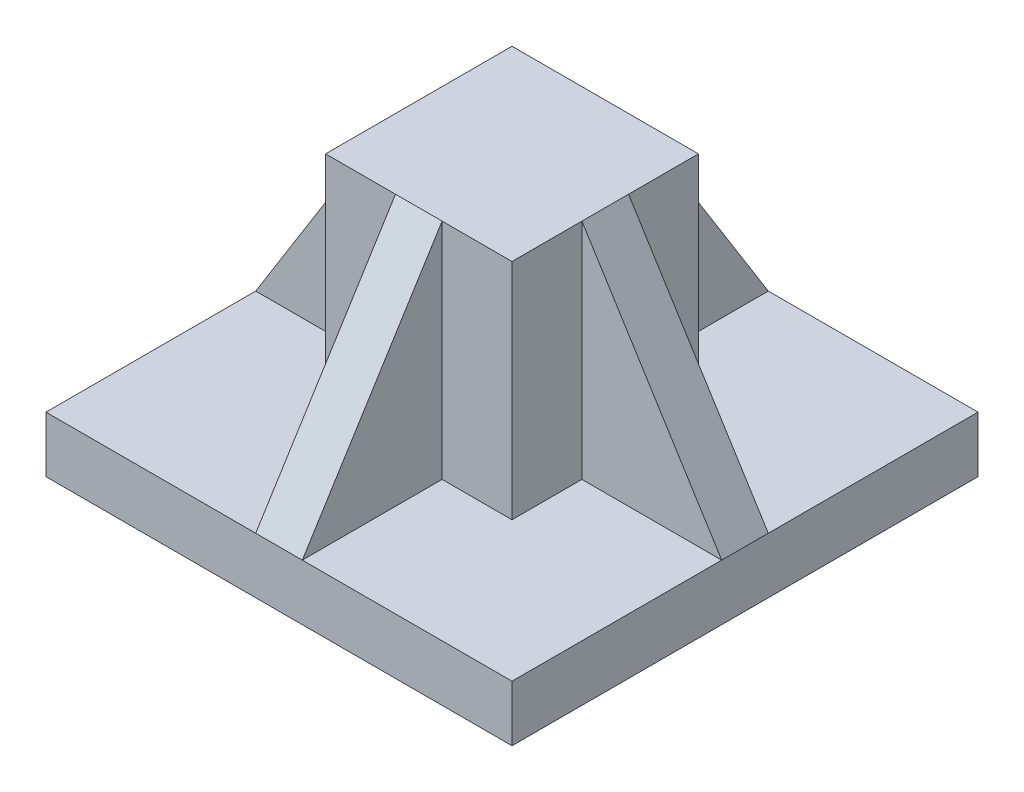
ISO-10303-21;
HEADER;
FILE_DESCRIPTION(('STEP AP214'),'2;1');
FILE_NAME('part.step','',(''),(''),'','','');
FILE_SCHEMA(('AUTOMOTIVE_DESIGN { 1 0 10303 214 1 1 1 1 }'));
ENDSEC;
DATA;
#1=APPLICATION_CONTEXT('core data for automotive mechanical design processes');
#2=APPLICATION_PROTOCOL_DEFINITION('international standard','automotive_design',2000,#1);
#3=PRODUCT_CONTEXT('',#1,'mechanical');
#4=PRODUCT('Part','Part','',(#3));
#5=PRODUCT_RELATED_PRODUCT_CATEGORY('part','',(#4));
#6=PRODUCT_DEFINITION_FORMATION('','',#4);
#7=PRODUCT_DEFINITION_CONTEXT('part definition',#1,'design');
#8=PRODUCT_DEFINITION('design','',#6,#7);
#9=PRODUCT_DEFINITION_SHAPE('','',#8);
#10=(LENGTH_UNIT() NAMED_UNIT(*) SI_UNIT(.MILLI.,.METRE.));
#11=(NAMED_UNIT(*) PLANE_ANGLE_UNIT() SI_UNIT($,.RADIAN.));
#12=(NAMED_UNIT(*) SI_UNIT($,.STERADIAN.) SOLID_ANGLE_UNIT());
#13=UNCERTAINTY_MEASURE_WITH_UNIT(LENGTH_MEASURE(1.E-05),#10,'distance_accuracy_value','');
#14=(GEOMETRIC_REPRESENTATION_CONTEXT(3) GLOBAL_UNCERTAINTY_ASSIGNED_CONTEXT((#13)) GLOBAL_UNIT_ASSIGNED_CONTEXT((#10,
#11,#12)) REPRESENTATION_CONTEXT('',''));
#15=CARTESIAN_POINT('',(0.,0.,0.));
#16=DIRECTION('',(0.,0.,1.));
#17=DIRECTION('',(1.,0.,0.));
#18=AXIS2_PLACEMENT_3D('',#15,#16,#17);
#19=CARTESIAN_POINT('',(0.,12.,0.));
#20=DIRECTION('',(0.,-1.,0.));
#21=DIRECTION('',(0.,0.,-1.));
#22=AXIS2_PLACEMENT_3D('',#19,#20,#21);
#23=PLANE('',#22);
#24=DIRECTION('',(0.,0.,-1.));
#25=VECTOR('',#24,1.);
#26=CARTESIAN_POINT('',(-5.,12.,-50.));
#27=LINE('',#26,#25);
#28=CARTESIAN_POINT('',(-5.,12.,-20.));
#29=VERTEX_POINT('',#28);
#30=CARTESIAN_POINT('',(-5.,12.,-50.));
#31=VERTEX_POINT('',#30);
#32=EDGE_CURVE('E418',#29,#31,#27,.T.);
#33=ORIENTED_EDGE('',*,*,#32,.T.);
#34=DIRECTION('',(-1.,0.,0.));
#35=VECTOR('',#34,1.);
#36=CARTESIAN_POINT('',(-50.,12.,-50.));
#37=LINE('',#36,#35);
#38=CARTESIAN_POINT('',(-50.,12.,-50.));
#39=VERTEX_POINT('',#38);
#40=EDGE_CURVE('E237',#31,#39,#37,.T.);
#41=ORIENTED_EDGE('',*,*,#40,.T.);
#42=DIRECTION('',(0.,0.,1.));
#43=VECTOR('',#42,1.);
#44=CARTESIAN_POINT('',(-50.,12.,50.));
#45=LINE('',#44,#43);
#46=CARTESIAN_POINT('',(-50.,12.,-5.));
#47=VERTEX_POINT('',#46);
#48=EDGE_CURVE('E244',#39,#47,#45,.T.);
#49=ORIENTED_EDGE('',*,*,#48,.T.);
#50=DIRECTION('',(1.,0.,0.));
#51=VECTOR('',#50,1.);
#52=CARTESIAN_POINT('',(-20.,12.,-5.));
#53=LINE('',#52,#51);
#54=CARTESIAN_POINT('',(-20.,12.,-5.));
#55=VERTEX_POINT('',#54);
#56=EDGE_CURVE('E369',#47,#55,#53,.T.);
#57=ORIENTED_EDGE('',*,*,#56,.T.);
#58=DIRECTION('',(0.,0.,1.));
#59=VECTOR('',#58,1.);
#60=CARTESIAN_POINT('',(-20.,12.,0.));
#61=LINE('',#60,#59);
#62=CARTESIAN_POINT('',(-20.,12.,-20.));
#63=VERTEX_POINT('',#62);
#64=EDGE_CURVE('E220',#63,#55,#61,.T.);
#65=ORIENTED_EDGE('',*,*,#64,.F.);
#66=DIRECTION('',(-1.,0.,0.));
#67=VECTOR('',#66,1.);
#68=CARTESIAN_POINT('',(0.,12.,-20.));
#69=LINE('',#68,#67);
#70=EDGE_CURVE('E224',#29,#63,#69,.T.);
#71=ORIENTED_EDGE('',*,*,#70,.F.);
#72=EDGE_LOOP('',(#33,#41,#49,#57,#65,#71));
#73=FACE_BOUND('',#72,.T.);
#74=ADVANCED_FACE('F45',(#73),#23,.F.);
#75=DIRECTION('',(0.,0.,-1.));
#76=VECTOR('',#75,1.);
#77=CARTESIAN_POINT('',(-5.,12.,20.));
#78=LINE('',#77,#76);
#79=CARTESIAN_POINT('',(-5.,12.,50.));
#80=VERTEX_POINT('',#79);
#81=CARTESIAN_POINT('',(-5.,12.,20.));
#82=VERTEX_POINT('',#81);
#83=EDGE_CURVE('E321',#80,#82,#78,.T.);
#84=ORIENTED_EDGE('',*,*,#83,.T.);
#85=DIRECTION('',(1.,0.,0.));
#86=VECTOR('',#85,1.);
#87=CARTESIAN_POINT('',(0.,12.,20.));
#88=LINE('',#87,#86);
#89=CARTESIAN_POINT('',(-20.,12.,20.));
#90=VERTEX_POINT('',#89);
#91=EDGE_CURVE('E208',#90,#82,#88,.T.);
#92=ORIENTED_EDGE('',*,*,#91,.F.);
#93=CARTESIAN_POINT('',(-20.,12.,5.));
#94=VERTEX_POINT('',#93);
#95=EDGE_CURVE('E214',#94,#90,#61,.T.);
#96=ORIENTED_EDGE('',*,*,#95,.F.);
#97=DIRECTION('',(1.,0.,0.));
#98=VECTOR('',#97,1.);
#99=CARTESIAN_POINT('',(-20.,12.,5.));
#100=LINE('',#99,#98);
#101=CARTESIAN_POINT('',(-50.,12.,5.));
#102=VERTEX_POINT('',#101);
#103=EDGE_CURVE('E359',#102,#94,#100,.T.);
#104=ORIENTED_EDGE('',*,*,#103,.F.);
#105=CARTESIAN_POINT('',(-50.,12.,50.));
#106=VERTEX_POINT('',#105);
#107=EDGE_CURVE('E243',#102,#106,#45,.T.);
#108=ORIENTED_EDGE('',*,*,#107,.T.);
#109=DIRECTION('',(1.,0.,0.));
#110=VECTOR('',#109,1.);
#111=CARTESIAN_POINT('',(-50.,12.,50.));
#112=LINE('',#111,#110);
#113=EDGE_CURVE('E249',#106,#80,#112,.T.);
#114=ORIENTED_EDGE('',*,*,#113,.T.);
#115=EDGE_LOOP('',(#84,#92,#96,#104,#108,#114));
#116=FACE_BOUND('',#115,.T.);
#117=ADVANCED_FACE('F320',(#116),#23,.F.);
#118=CARTESIAN_POINT('',(-20.,60.,-20.));
#119=DIRECTION('',(0.,0.,1.));
#120=DIRECTION('',(1.,0.,0.));
#121=AXIS2_PLACEMENT_3D('',#118,#119,#120);
#122=PLANE('',#121);
#123=DIRECTION('',(0.,-1.,0.));
#124=VECTOR('',#123,1.);
#125=CARTESIAN_POINT('',(-5.,12.,-20.));
#126=LINE('',#125,#124);
#127=CARTESIAN_POINT('',(-5.,60.,-20.));
#128=VERTEX_POINT('',#127);
#129=EDGE_CURVE('E414',#128,#29,#126,.T.);
#130=ORIENTED_EDGE('',*,*,#129,.T.);
#131=ORIENTED_EDGE('',*,*,#70,.T.);
#132=DIRECTION('',(0.,-1.,0.));
#133=VECTOR('',#132,1.);
#134=CARTESIAN_POINT('',(-20.,60.,-20.));
#135=LINE('',#134,#133);
#136=CARTESIAN_POINT('',(-20.,60.,-20.));
#137=VERTEX_POINT('',#136);
#138=EDGE_CURVE('E216',#137,#63,#135,.T.);
#139=ORIENTED_EDGE('',*,*,#138,.F.);
#140=DIRECTION('',(-1.,0.,0.));
#141=VECTOR('',#140,1.);
#142=CARTESIAN_POINT('',(-20.,60.,-20.));
#143=LINE('',#142,#141);
#144=EDGE_CURVE('E346',#128,#137,#143,.T.);
#145=ORIENTED_EDGE('',*,*,#144,.F.);
#146=EDGE_LOOP('',(#130,#131,#139,#145));
#147=FACE_BOUND('',#146,.T.);
#148=ADVANCED_FACE('F491',(#147),#122,.F.);
#149=CARTESIAN_POINT('',(-20.,60.,20.));
#150=DIRECTION('',(0.,0.,-1.));
#151=DIRECTION('',(-1.,0.,0.));
#152=AXIS2_PLACEMENT_3D('',#149,#150,#151);
#153=PLANE('',#152);
#154=DIRECTION('',(0.,1.,0.));
#155=VECTOR('',#154,1.);
#156=CARTESIAN_POINT('',(-5.,60.,20.));
#157=LINE('',#156,#155);
#158=CARTESIAN_POINT('',(-5.,60.,20.));
#159=VERTEX_POINT('',#158);
#160=EDGE_CURVE('E440',#82,#159,#157,.T.);
#161=ORIENTED_EDGE('',*,*,#160,.T.);
#162=DIRECTION('',(1.,0.,0.));
#163=VECTOR('',#162,1.);
#164=CARTESIAN_POINT('',(-20.,60.,20.));
#165=LINE('',#164,#163);
#166=CARTESIAN_POINT('',(-20.,60.,20.));
#167=VERTEX_POINT('',#166);
#168=EDGE_CURVE('E326',#167,#159,#165,.T.);
#169=ORIENTED_EDGE('',*,*,#168,.F.);
#170=DIRECTION('',(0.,-1.,0.));
#171=VECTOR('',#170,1.);
#172=CARTESIAN_POINT('',(-20.,60.,20.));
#173=LINE('',#172,#171);
#174=EDGE_CURVE('E314',#167,#90,#173,.T.);
#175=ORIENTED_EDGE('',*,*,#174,.T.);
#176=ORIENTED_EDGE('',*,*,#91,.T.);
#177=EDGE_LOOP('',(#161,#169,#175,#176));
#178=FACE_BOUND('',#177,.T.);
#179=ADVANCED_FACE('F324',(#178),#153,.F.);
#180=CARTESIAN_POINT('',(50.,12.,-50.));
#181=VERTEX_POINT('',#180);
#182=CARTESIAN_POINT('',(5.,12.,-50.));
#183=VERTEX_POINT('',#182);
#184=EDGE_CURVE('E239',#181,#183,#37,.T.);
#185=ORIENTED_EDGE('',*,*,#184,.T.);
#186=DIRECTION('',(0.,0.,-1.));
#187=VECTOR('',#186,1.);
#188=CARTESIAN_POINT('',(5.,12.,-50.));
#189=LINE('',#188,#187);
#190=CARTESIAN_POINT('',(5.,12.,-20.));
#191=VERTEX_POINT('',#190);
#192=EDGE_CURVE('E407',#191,#183,#189,.T.);
#193=ORIENTED_EDGE('',*,*,#192,.F.);
#194=CARTESIAN_POINT('',(20.,12.,-20.));
#195=VERTEX_POINT('',#194);
#196=EDGE_CURVE('E225',#195,#191,#69,.T.);
#197=ORIENTED_EDGE('',*,*,#196,.F.);
#198=DIRECTION('',(0.,0.,-1.));
#199=VECTOR('',#198,1.);
#200=CARTESIAN_POINT('',(20.,12.,0.));
#201=LINE('',#200,#199);
#202=CARTESIAN_POINT('',(20.,12.,-5.));
#203=VERTEX_POINT('',#202);
#204=EDGE_CURVE('E229',#203,#195,#201,.T.);
#205=ORIENTED_EDGE('',*,*,#204,.F.);
#206=DIRECTION('',(1.,0.,0.));
#207=VECTOR('',#206,1.);
#208=CARTESIAN_POINT('',(50.,12.,-5.));
#209=LINE('',#208,#207);
#210=CARTESIAN_POINT('',(50.,12.,-5.));
#211=VERTEX_POINT('',#210);
#212=EDGE_CURVE('E389',#203,#211,#209,.T.);
#213=ORIENTED_EDGE('',*,*,#212,.T.);
#214=DIRECTION('',(0.,0.,-1.));
#215=VECTOR('',#214,1.);
#216=CARTESIAN_POINT('',(50.,12.,50.));
#217=LINE('',#216,#215);
#218=EDGE_CURVE('E238',#211,#181,#217,.T.);
#219=ORIENTED_EDGE('',*,*,#218,.T.);
#220=EDGE_LOOP('',(#185,#193,#197,#205,#213,#219));
#221=FACE_BOUND('',#220,.T.);
#222=ADVANCED_FACE('F477',(#221),#23,.F.);
#223=CARTESIAN_POINT('',(20.,60.,20.));
#224=DIRECTION('',(-1.,0.,0.));
#225=DIRECTION('',(0.,0.,1.));
#226=AXIS2_PLACEMENT_3D('',#223,#224,#225);
#227=PLANE('',#226);
#228=DIRECTION('',(0.,-1.,0.));
#229=VECTOR('',#228,1.);
#230=CARTESIAN_POINT('',(20.,12.,-5.));
#231=LINE('',#230,#229);
#232=CARTESIAN_POINT('',(20.,60.,-5.));
#233=VERTEX_POINT('',#232);
#234=EDGE_CURVE('E393',#233,#203,#231,.T.);
#235=ORIENTED_EDGE('',*,*,#234,.T.);
#236=ORIENTED_EDGE('',*,*,#204,.T.);
#237=DIRECTION('',(0.,-1.,0.));
#238=VECTOR('',#237,1.);
#239=CARTESIAN_POINT('',(20.,60.,-20.));
#240=LINE('',#239,#238);
#241=CARTESIAN_POINT('',(20.,60.,-20.));
#242=VERTEX_POINT('',#241);
#243=EDGE_CURVE('E209',#242,#195,#240,.T.);
#244=ORIENTED_EDGE('',*,*,#243,.F.);
#245=DIRECTION('',(0.,0.,-1.));
#246=VECTOR('',#245,1.);
#247=CARTESIAN_POINT('',(20.,60.,20.));
#248=LINE('',#247,#246);
#249=EDGE_CURVE('E351',#233,#242,#248,.T.);
#250=ORIENTED_EDGE('',*,*,#249,.F.);
#251=EDGE_LOOP('',(#235,#236,#244,#250));
#252=FACE_BOUND('',#251,.T.);
#253=ADVANCED_FACE('F472',(#252),#227,.F.);
#254=CARTESIAN_POINT('',(-20.,60.,20.));
#255=DIRECTION('',(1.,0.,0.));
#256=DIRECTION('',(0.,0.,-1.));
#257=AXIS2_PLACEMENT_3D('',#254,#255,#256);
#258=PLANE('',#257);
#259=DIRECTION('',(0.,1.,0.));
#260=VECTOR('',#259,1.);
#261=CARTESIAN_POINT('',(-20.,60.,5.));
#262=LINE('',#261,#260);
#263=CARTESIAN_POINT('',(-20.,60.,5.));
#264=VERTEX_POINT('',#263);
#265=EDGE_CURVE('E316',#94,#264,#262,.T.);
#266=ORIENTED_EDGE('',*,*,#265,.F.);
#267=ORIENTED_EDGE('',*,*,#95,.T.);
#268=ORIENTED_EDGE('',*,*,#174,.F.);
#269=DIRECTION('',(0.,0.,1.));
#270=VECTOR('',#269,1.);
#271=CARTESIAN_POINT('',(-20.,60.,20.));
#272=LINE('',#271,#270);
#273=EDGE_CURVE('E341',#264,#167,#272,.T.);
#274=ORIENTED_EDGE('',*,*,#273,.F.);
#275=EDGE_LOOP('',(#266,#267,#268,#274));
#276=FACE_BOUND('',#275,.T.);
#277=ADVANCED_FACE('F311',(#276),#258,.F.);
#278=CARTESIAN_POINT('',(5.,12.,20.));
#279=VERTEX_POINT('',#278);
#280=CARTESIAN_POINT('',(20.,12.,20.));
#281=VERTEX_POINT('',#280);
#282=EDGE_CURVE('E196',#279,#281,#88,.T.);
#283=ORIENTED_EDGE('',*,*,#282,.F.);
#284=DIRECTION('',(0.,0.,-1.));
#285=VECTOR('',#284,1.);
#286=CARTESIAN_POINT('',(5.,12.,20.));
#287=LINE('',#286,#285);
#288=CARTESIAN_POINT('',(5.,12.,50.));
#289=VERTEX_POINT('',#288);
#290=EDGE_CURVE('E182',#289,#279,#287,.T.);
#291=ORIENTED_EDGE('',*,*,#290,.F.);
#292=CARTESIAN_POINT('',(50.,12.,50.));
#293=VERTEX_POINT('',#292);
#294=EDGE_CURVE('E248',#289,#293,#112,.T.);
#295=ORIENTED_EDGE('',*,*,#294,.T.);
#296=CARTESIAN_POINT('',(50.,12.,5.));
#297=VERTEX_POINT('',#296);
#298=EDGE_CURVE('E233',#293,#297,#217,.T.);
#299=ORIENTED_EDGE('',*,*,#298,.T.);
#300=DIRECTION('',(1.,0.,0.));
#301=VECTOR('',#300,1.);
#302=CARTESIAN_POINT('',(50.,12.,5.));
#303=LINE('',#302,#301);
#304=CARTESIAN_POINT('',(20.,12.,5.));
#305=VERTEX_POINT('',#304);
#306=EDGE_CURVE('E297',#305,#297,#303,.T.);
#307=ORIENTED_EDGE('',*,*,#306,.F.);
#308=EDGE_CURVE('E205',#281,#305,#201,.T.);
#309=ORIENTED_EDGE('',*,*,#308,.F.);
#310=EDGE_LOOP('',(#283,#291,#295,#299,#307,#309));
#311=FACE_BOUND('',#310,.T.);
#312=ADVANCED_FACE('F202',(#311),#23,.F.);
#313=CARTESIAN_POINT('',(50.,12.,50.));
#314=DIRECTION('',(-1.,0.,0.));
#315=DIRECTION('',(0.,0.,1.));
#316=AXIS2_PLACEMENT_3D('',#313,#314,#315);
#317=PLANE('',#316);
#318=DIRECTION('',(0.,0.,-1.));
#319=VECTOR('',#318,1.);
#320=CARTESIAN_POINT('',(50.,0.,50.));
#321=LINE('',#320,#319);
#322=CARTESIAN_POINT('',(50.,0.,50.));
#323=VERTEX_POINT('',#322);
#324=CARTESIAN_POINT('',(50.,0.,-50.));
#325=VERTEX_POINT('',#324);
#326=EDGE_CURVE('E232',#323,#325,#321,.T.);
#327=ORIENTED_EDGE('',*,*,#326,.T.);
#328=DIRECTION('',(0.,-1.,0.));
#329=VECTOR('',#328,1.);
#330=CARTESIAN_POINT('',(50.,12.,-50.));
#331=LINE('',#330,#329);
#332=EDGE_CURVE('E11',#181,#325,#331,.T.);
#333=ORIENTED_EDGE('',*,*,#332,.F.);
#334=ORIENTED_EDGE('',*,*,#218,.F.);
#335=DIRECTION('',(0.,0.,1.));
#336=VECTOR('',#335,1.);
#337=CARTESIAN_POINT('',(50.,12.,-5.));
#338=LINE('',#337,#336);
#339=EDGE_CURVE('E296',#211,#297,#338,.T.);
#340=ORIENTED_EDGE('',*,*,#339,.T.);
#341=ORIENTED_EDGE('',*,*,#298,.F.);
#342=DIRECTION('',(0.,-1.,0.));
#343=VECTOR('',#342,1.);
#344=CARTESIAN_POINT('',(50.,12.,50.));
#345=LINE('',#344,#343);
#346=EDGE_CURVE('E253',#293,#323,#345,.T.);
#347=ORIENTED_EDGE('',*,*,#346,.T.);
#348=EDGE_LOOP('',(#327,#333,#334,#340,#341,#347));
#349=FACE_BOUND('',#348,.T.);
#350=ADVANCED_FACE('F47',(#349),#317,.F.);
#351=CARTESIAN_POINT('',(-50.,12.,-50.));
#352=DIRECTION('',(0.,0.,1.));
#353=DIRECTION('',(1.,0.,0.));
#354=AXIS2_PLACEMENT_3D('',#351,#352,#353);
#355=PLANE('',#354);
#356=DIRECTION('',(-1.,0.,0.));
#357=VECTOR('',#356,1.);
#358=CARTESIAN_POINT('',(-50.,0.,-50.));
#359=LINE('',#358,#357);
#360=CARTESIAN_POINT('',(-50.,0.,-50.));
#361=VERTEX_POINT('',#360);
#362=EDGE_CURVE('E257',#325,#361,#359,.T.);
#363=ORIENTED_EDGE('',*,*,#362,.T.);
#364=DIRECTION('',(0.,-1.,0.));
#365=VECTOR('',#364,1.);
#366=CARTESIAN_POINT('',(-50.,12.,-50.));
#367=LINE('',#366,#365);
#368=EDGE_CURVE('E54',#39,#361,#367,.T.);
#369=ORIENTED_EDGE('',*,*,#368,.F.);
#370=ORIENTED_EDGE('',*,*,#40,.F.);
#371=DIRECTION('',(1.,0.,0.));
#372=VECTOR('',#371,1.);
#373=CARTESIAN_POINT('',(-5.,12.,-50.));
#374=LINE('',#373,#372);
#375=EDGE_CURVE('E424',#31,#183,#374,.T.);
#376=ORIENTED_EDGE('',*,*,#375,.T.);
#377=ORIENTED_EDGE('',*,*,#184,.F.);
#378=ORIENTED_EDGE('',*,*,#332,.T.);
#379=EDGE_LOOP('',(#363,#369,#370,#376,#377,#378));
#380=FACE_BOUND('',#379,.T.);
#381=ADVANCED_FACE('F483',(#380),#355,.F.);
#382=CARTESIAN_POINT('',(-50.,12.,50.));
#383=DIRECTION('',(1.,0.,0.));
#384=DIRECTION('',(0.,0.,-1.));
#385=AXIS2_PLACEMENT_3D('',#382,#383,#384);
#386=PLANE('',#385);
#387=DIRECTION('',(0.,0.,1.));
#388=VECTOR('',#387,1.);
#389=CARTESIAN_POINT('',(-50.,0.,50.));
#390=LINE('',#389,#388);
#391=CARTESIAN_POINT('',(-50.,0.,50.));
#392=VERTEX_POINT('',#391);
#393=EDGE_CURVE('E260',#361,#392,#390,.T.);
#394=ORIENTED_EDGE('',*,*,#393,.T.);
#395=DIRECTION('',(0.,-1.,0.));
#396=VECTOR('',#395,1.);
#397=CARTESIAN_POINT('',(-50.,12.,50.));
#398=LINE('',#397,#396);
#399=EDGE_CURVE('E269',#106,#392,#398,.T.);
#400=ORIENTED_EDGE('',*,*,#399,.F.);
#401=ORIENTED_EDGE('',*,*,#107,.F.);
#402=DIRECTION('',(0.,0.,1.));
#403=VECTOR('',#402,1.);
#404=CARTESIAN_POINT('',(-50.,12.,-5.));
#405=LINE('',#404,#403);
#406=EDGE_CURVE('E374',#47,#102,#405,.T.);
#407=ORIENTED_EDGE('',*,*,#406,.F.);
#408=ORIENTED_EDGE('',*,*,#48,.F.);
#409=ORIENTED_EDGE('',*,*,#368,.T.);
#410=EDGE_LOOP('',(#394,#400,#401,#407,#408,#409));
#411=FACE_BOUND('',#410,.T.);
#412=ADVANCED_FACE('F278',(#411),#386,.F.);
#413=CARTESIAN_POINT('',(-50.,12.,50.));
#414=DIRECTION('',(0.,0.,-1.));
#415=DIRECTION('',(-1.,0.,0.));
#416=AXIS2_PLACEMENT_3D('',#413,#414,#415);
#417=PLANE('',#416);
#418=DIRECTION('',(1.,0.,0.));
#419=VECTOR('',#418,1.);
#420=CARTESIAN_POINT('',(-50.,0.,50.));
#421=LINE('',#420,#419);
#422=EDGE_CURVE('E263',#392,#323,#421,.T.);
#423=ORIENTED_EDGE('',*,*,#422,.T.);
#424=ORIENTED_EDGE('',*,*,#346,.F.);
#425=ORIENTED_EDGE('',*,*,#294,.F.);
#426=DIRECTION('',(1.,0.,0.));
#427=VECTOR('',#426,1.);
#428=CARTESIAN_POINT('',(-5.,12.,50.));
#429=LINE('',#428,#427);
#430=EDGE_CURVE('E377',#80,#289,#429,.T.);
#431=ORIENTED_EDGE('',*,*,#430,.F.);
#432=ORIENTED_EDGE('',*,*,#113,.F.);
#433=ORIENTED_EDGE('',*,*,#399,.T.);
#434=EDGE_LOOP('',(#423,#424,#425,#431,#432,#433));
#435=FACE_BOUND('',#434,.T.);
#436=ADVANCED_FACE('F289',(#435),#417,.F.);
#437=CARTESIAN_POINT('',(0.,0.,0.));
#438=DIRECTION('',(0.,-1.,0.));
#439=DIRECTION('',(0.,0.,-1.));
#440=AXIS2_PLACEMENT_3D('',#437,#438,#439);
#441=PLANE('',#440);
#442=ORIENTED_EDGE('',*,*,#326,.F.);
#443=ORIENTED_EDGE('',*,*,#422,.F.);
#444=ORIENTED_EDGE('',*,*,#393,.F.);
#445=ORIENTED_EDGE('',*,*,#362,.F.);
#446=EDGE_LOOP('',(#442,#443,#444,#445));
#447=FACE_BOUND('',#446,.T.);
#448=ADVANCED_FACE('F286',(#447),#441,.T.);
#449=ORIENTED_EDGE('',*,*,#308,.T.);
#450=DIRECTION('',(0.,-1.,0.));
#451=VECTOR('',#450,1.);
#452=CARTESIAN_POINT('',(20.,12.,5.));
#453=LINE('',#452,#451);
#454=CARTESIAN_POINT('',(20.,60.,5.));
#455=VERTEX_POINT('',#454);
#456=EDGE_CURVE('E354',#455,#305,#453,.T.);
#457=ORIENTED_EDGE('',*,*,#456,.F.);
#458=CARTESIAN_POINT('',(20.,60.,20.));
#459=VERTEX_POINT('',#458);
#460=EDGE_CURVE('E347',#459,#455,#248,.T.);
#461=ORIENTED_EDGE('',*,*,#460,.F.);
#462=DIRECTION('',(0.,-1.,0.));
#463=VECTOR('',#462,1.);
#464=CARTESIAN_POINT('',(20.,60.,20.));
#465=LINE('',#464,#463);
#466=EDGE_CURVE('E328',#459,#281,#465,.T.);
#467=ORIENTED_EDGE('',*,*,#466,.T.);
#468=EDGE_LOOP('',(#449,#457,#461,#467));
#469=FACE_BOUND('',#468,.T.);
#470=ADVANCED_FACE('F456',(#469),#227,.F.);
#471=ORIENTED_EDGE('',*,*,#196,.T.);
#472=DIRECTION('',(0.,-1.,0.));
#473=VECTOR('',#472,1.);
#474=CARTESIAN_POINT('',(5.,12.,-20.));
#475=LINE('',#474,#473);
#476=CARTESIAN_POINT('',(5.,60.,-20.));
#477=VERTEX_POINT('',#476);
#478=EDGE_CURVE('E191',#477,#191,#475,.T.);
#479=ORIENTED_EDGE('',*,*,#478,.F.);
#480=EDGE_CURVE('E342',#242,#477,#143,.T.);
#481=ORIENTED_EDGE('',*,*,#480,.F.);
#482=ORIENTED_EDGE('',*,*,#243,.T.);
#483=EDGE_LOOP('',(#471,#479,#481,#482));
#484=FACE_BOUND('',#483,.T.);
#485=ADVANCED_FACE('F471',(#484),#122,.F.);
#486=ORIENTED_EDGE('',*,*,#64,.T.);
#487=DIRECTION('',(0.,1.,0.));
#488=VECTOR('',#487,1.);
#489=CARTESIAN_POINT('',(-20.,60.,-5.));
#490=LINE('',#489,#488);
#491=CARTESIAN_POINT('',(-20.,60.,-5.));
#492=VERTEX_POINT('',#491);
#493=EDGE_CURVE('E362',#55,#492,#490,.T.);
#494=ORIENTED_EDGE('',*,*,#493,.T.);
#495=EDGE_CURVE('E337',#137,#492,#272,.T.);
#496=ORIENTED_EDGE('',*,*,#495,.F.);
#497=ORIENTED_EDGE('',*,*,#138,.T.);
#498=EDGE_LOOP('',(#486,#494,#496,#497));
#499=FACE_BOUND('',#498,.T.);
#500=ADVANCED_FACE('F495',(#499),#258,.F.);
#501=CARTESIAN_POINT('',(5.,60.,20.));
#502=VERTEX_POINT('',#501);
#503=EDGE_CURVE('E198',#502,#459,#165,.T.);
#504=ORIENTED_EDGE('',*,*,#503,.F.);
#505=DIRECTION('',(0.,1.,0.));
#506=VECTOR('',#505,1.);
#507=CARTESIAN_POINT('',(5.,60.,20.));
#508=LINE('',#507,#506);
#509=EDGE_CURVE('E185',#279,#502,#508,.T.);
#510=ORIENTED_EDGE('',*,*,#509,.F.);
#511=ORIENTED_EDGE('',*,*,#282,.T.);
#512=ORIENTED_EDGE('',*,*,#466,.F.);
#513=EDGE_LOOP('',(#504,#510,#511,#512));
#514=FACE_BOUND('',#513,.T.);
#515=ADVANCED_FACE('F194',(#514),#153,.F.);
#516=CARTESIAN_POINT('',(0.,60.,0.));
#517=DIRECTION('',(0.,-1.,0.));
#518=DIRECTION('',(0.,0.,-1.));
#519=AXIS2_PLACEMENT_3D('',#516,#517,#518);
#520=PLANE('',#519);
#521=ORIENTED_EDGE('',*,*,#460,.T.);
#522=DIRECTION('',(0.,0.,1.));
#523=VECTOR('',#522,1.);
#524=CARTESIAN_POINT('',(20.,60.,-5.));
#525=LINE('',#524,#523);
#526=EDGE_CURVE('E383',#233,#455,#525,.T.);
#527=ORIENTED_EDGE('',*,*,#526,.F.);
#528=ORIENTED_EDGE('',*,*,#249,.T.);
#529=ORIENTED_EDGE('',*,*,#480,.T.);
#530=DIRECTION('',(1.,0.,0.));
#531=VECTOR('',#530,1.);
#532=CARTESIAN_POINT('',(-5.,60.,-20.));
#533=LINE('',#532,#531);
#534=EDGE_CURVE('E425',#128,#477,#533,.T.);
#535=ORIENTED_EDGE('',*,*,#534,.F.);
#536=ORIENTED_EDGE('',*,*,#144,.T.);
#537=ORIENTED_EDGE('',*,*,#495,.T.);
#538=DIRECTION('',(0.,0.,1.));
#539=VECTOR('',#538,1.);
#540=CARTESIAN_POINT('',(-20.,60.,-5.));
#541=LINE('',#540,#539);
#542=EDGE_CURVE('E373',#492,#264,#541,.T.);
#543=ORIENTED_EDGE('',*,*,#542,.T.);
#544=ORIENTED_EDGE('',*,*,#273,.T.);
#545=ORIENTED_EDGE('',*,*,#168,.T.);
#546=DIRECTION('',(1.,0.,0.));
#547=VECTOR('',#546,1.);
#548=CARTESIAN_POINT('',(-5.,60.,20.));
#549=LINE('',#548,#547);
#550=EDGE_CURVE('E431',#159,#502,#549,.T.);
#551=ORIENTED_EDGE('',*,*,#550,.T.);
#552=ORIENTED_EDGE('',*,*,#503,.T.);
#553=EDGE_LOOP('',(#521,#527,#528,#529,#535,#536,#537,#543,#544,#545,#551,#552));
#554=FACE_BOUND('',#553,.T.);
#555=ADVANCED_FACE('F451',(#554),#520,.F.);
#556=CARTESIAN_POINT('',(-20.,60.,-5.));
#557=DIRECTION('',(-0.847998304005088,0.52999894000318,0.));
#558=DIRECTION('',(-0.52999894000318,-0.847998304005088,0.));
#559=AXIS2_PLACEMENT_3D('',#556,#557,#558);
#560=PLANE('',#559);
#561=ORIENTED_EDGE('',*,*,#406,.T.);
#562=DIRECTION('',(-0.52999894000318,-0.847998304005088,0.));
#563=VECTOR('',#562,1.);
#564=CARTESIAN_POINT('',(-20.,60.,5.));
#565=LINE('',#564,#563);
#566=EDGE_CURVE('E355',#264,#102,#565,.T.);
#567=ORIENTED_EDGE('',*,*,#566,.F.);
#568=ORIENTED_EDGE('',*,*,#542,.F.);
#569=DIRECTION('',(-0.52999894000318,-0.847998304005088,0.));
#570=VECTOR('',#569,1.);
#571=CARTESIAN_POINT('',(-20.,60.,-5.));
#572=LINE('',#571,#570);
#573=EDGE_CURVE('E366',#492,#47,#572,.T.);
#574=ORIENTED_EDGE('',*,*,#573,.T.);
#575=EDGE_LOOP('',(#561,#567,#568,#574));
#576=FACE_BOUND('',#575,.T.);
#577=ADVANCED_FACE('F501',(#576),#560,.T.);
#578=CARTESIAN_POINT('',(0.,0.,-5.));
#579=DIRECTION('',(0.,0.,-1.));
#580=DIRECTION('',(-1.,0.,0.));
#581=AXIS2_PLACEMENT_3D('',#578,#579,#580);
#582=PLANE('',#581);
#583=ORIENTED_EDGE('',*,*,#493,.F.);
#584=ORIENTED_EDGE('',*,*,#56,.F.);
#585=ORIENTED_EDGE('',*,*,#573,.F.);
#586=EDGE_LOOP('',(#583,#584,#585));
#587=FACE_BOUND('',#586,.T.);
#588=ADVANCED_FACE('F499',(#587),#582,.T.);
#589=CARTESIAN_POINT('',(0.,0.,5.));
#590=DIRECTION('',(0.,0.,-1.));
#591=DIRECTION('',(-1.,0.,0.));
#592=AXIS2_PLACEMENT_3D('',#589,#590,#591);
#593=PLANE('',#592);
#594=ORIENTED_EDGE('',*,*,#265,.T.);
#595=ORIENTED_EDGE('',*,*,#566,.T.);
#596=ORIENTED_EDGE('',*,*,#103,.T.);
#597=EDGE_LOOP('',(#594,#595,#596));
#598=FACE_BOUND('',#597,.T.);
#599=ADVANCED_FACE('F504',(#598),#593,.F.);
#600=CARTESIAN_POINT('',(20.,60.,-5.));
#601=DIRECTION('',(0.847998304005088,0.52999894000318,0.));
#602=DIRECTION('',(-0.52999894000318,0.847998304005088,0.));
#603=AXIS2_PLACEMENT_3D('',#600,#601,#602);
#604=PLANE('',#603);
#605=ORIENTED_EDGE('',*,*,#526,.T.);
#606=DIRECTION('',(-0.52999894000318,0.847998304005088,0.));
#607=VECTOR('',#606,1.);
#608=CARTESIAN_POINT('',(20.,60.,5.));
#609=LINE('',#608,#607);
#610=EDGE_CURVE('E397',#297,#455,#609,.T.);
#611=ORIENTED_EDGE('',*,*,#610,.F.);
#612=ORIENTED_EDGE('',*,*,#339,.F.);
#613=DIRECTION('',(-0.52999894000318,0.847998304005088,0.));
#614=VECTOR('',#613,1.);
#615=CARTESIAN_POINT('',(20.,60.,-5.));
#616=LINE('',#615,#614);
#617=EDGE_CURVE('E384',#211,#233,#616,.T.);
#618=ORIENTED_EDGE('',*,*,#617,.T.);
#619=EDGE_LOOP('',(#605,#611,#612,#618));
#620=FACE_BOUND('',#619,.T.);
#621=ADVANCED_FACE('F461',(#620),#604,.T.);
#622=CARTESIAN_POINT('',(0.,0.,-5.));
#623=DIRECTION('',(0.,0.,1.));
#624=DIRECTION('',(1.,0.,0.));
#625=AXIS2_PLACEMENT_3D('',#622,#623,#624);
#626=PLANE('',#625);
#627=ORIENTED_EDGE('',*,*,#234,.F.);
#628=ORIENTED_EDGE('',*,*,#617,.F.);
#629=ORIENTED_EDGE('',*,*,#212,.F.);
#630=EDGE_LOOP('',(#627,#628,#629));
#631=FACE_BOUND('',#630,.T.);
#632=ADVANCED_FACE('F644',(#631),#626,.F.);
#633=CARTESIAN_POINT('',(0.,0.,5.));
#634=DIRECTION('',(0.,0.,1.));
#635=DIRECTION('',(1.,0.,0.));
#636=AXIS2_PLACEMENT_3D('',#633,#634,#635);
#637=PLANE('',#636);
#638=ORIENTED_EDGE('',*,*,#456,.T.);
#639=ORIENTED_EDGE('',*,*,#306,.T.);
#640=ORIENTED_EDGE('',*,*,#610,.T.);
#641=EDGE_LOOP('',(#638,#639,#640));
#642=FACE_BOUND('',#641,.T.);
#643=ADVANCED_FACE('F458',(#642),#637,.T.);
#644=CARTESIAN_POINT('',(-5.,60.,-20.));
#645=DIRECTION('',(0.,0.52999894000318,-0.847998304005088));
#646=DIRECTION('',(0.,0.847998304005088,0.52999894000318));
#647=AXIS2_PLACEMENT_3D('',#644,#645,#646);
#648=PLANE('',#647);
#649=ORIENTED_EDGE('',*,*,#534,.T.);
#650=DIRECTION('',(0.,0.847998304005088,0.52999894000318));
#651=VECTOR('',#650,1.);
#652=CARTESIAN_POINT('',(5.,60.,-20.));
#653=LINE('',#652,#651);
#654=EDGE_CURVE('E410',#183,#477,#653,.T.);
#655=ORIENTED_EDGE('',*,*,#654,.F.);
#656=ORIENTED_EDGE('',*,*,#375,.F.);
#657=DIRECTION('',(0.,0.847998304005088,0.52999894000318));
#658=VECTOR('',#657,1.);
#659=CARTESIAN_POINT('',(-5.,60.,-20.));
#660=LINE('',#659,#658);
#661=EDGE_CURVE('E69',#31,#128,#660,.T.);
#662=ORIENTED_EDGE('',*,*,#661,.T.);
#663=EDGE_LOOP('',(#649,#655,#656,#662));
#664=FACE_BOUND('',#663,.T.);
#665=ADVANCED_FACE('F482',(#664),#648,.T.);
#666=CARTESIAN_POINT('',(-5.,0.,0.));
#667=DIRECTION('',(1.,0.,0.));
#668=DIRECTION('',(0.,0.,-1.));
#669=AXIS2_PLACEMENT_3D('',#666,#667,#668);
#670=PLANE('',#669);
#671=ORIENTED_EDGE('',*,*,#129,.F.);
#672=ORIENTED_EDGE('',*,*,#661,.F.);
#673=ORIENTED_EDGE('',*,*,#32,.F.);
#674=EDGE_LOOP('',(#671,#672,#673));
#675=FACE_BOUND('',#674,.T.);
#676=ADVANCED_FACE('F488',(#675),#670,.F.);
#677=CARTESIAN_POINT('',(5.,0.,0.));
#678=DIRECTION('',(1.,0.,0.));
#679=DIRECTION('',(0.,0.,-1.));
#680=AXIS2_PLACEMENT_3D('',#677,#678,#679);
#681=PLANE('',#680);
#682=ORIENTED_EDGE('',*,*,#478,.T.);
#683=ORIENTED_EDGE('',*,*,#192,.T.);
#684=ORIENTED_EDGE('',*,*,#654,.T.);
#685=EDGE_LOOP('',(#682,#683,#684));
#686=FACE_BOUND('',#685,.T.);
#687=ADVANCED_FACE('F481',(#686),#681,.T.);
#688=CARTESIAN_POINT('',(-5.,12.,50.));
#689=DIRECTION('',(0.,0.52999894000318,0.847998304005088));
#690=DIRECTION('',(0.,-0.847998304005088,0.52999894000318));
#691=AXIS2_PLACEMENT_3D('',#688,#689,#690);
#692=PLANE('',#691);
#693=ORIENTED_EDGE('',*,*,#430,.T.);
#694=DIRECTION('',(0.,-0.847998304005088,0.52999894000318));
#695=VECTOR('',#694,1.);
#696=CARTESIAN_POINT('',(5.,12.,50.));
#697=LINE('',#696,#695);
#698=EDGE_CURVE('E61',#502,#289,#697,.T.);
#699=ORIENTED_EDGE('',*,*,#698,.F.);
#700=ORIENTED_EDGE('',*,*,#550,.F.);
#701=DIRECTION('',(0.,-0.847998304005088,0.52999894000318));
#702=VECTOR('',#701,1.);
#703=CARTESIAN_POINT('',(-5.,12.,50.));
#704=LINE('',#703,#702);
#705=EDGE_CURVE('E434',#159,#80,#704,.T.);
#706=ORIENTED_EDGE('',*,*,#705,.T.);
#707=EDGE_LOOP('',(#693,#699,#700,#706));
#708=FACE_BOUND('',#707,.T.);
#709=ADVANCED_FACE('F506',(#708),#692,.T.);
#710=CARTESIAN_POINT('',(-5.,0.,0.));
#711=DIRECTION('',(1.,0.,0.));
#712=DIRECTION('',(0.,0.,-1.));
#713=AXIS2_PLACEMENT_3D('',#710,#711,#712);
#714=PLANE('',#713);
#715=ORIENTED_EDGE('',*,*,#83,.F.);
#716=ORIENTED_EDGE('',*,*,#705,.F.);
#717=ORIENTED_EDGE('',*,*,#160,.F.);
#718=EDGE_LOOP('',(#715,#716,#717));
#719=FACE_BOUND('',#718,.T.);
#720=ADVANCED_FACE('F509',(#719),#714,.F.);
#721=CARTESIAN_POINT('',(5.,0.,0.));
#722=DIRECTION('',(1.,0.,0.));
#723=DIRECTION('',(0.,0.,-1.));
#724=AXIS2_PLACEMENT_3D('',#721,#722,#723);
#725=PLANE('',#724);
#726=ORIENTED_EDGE('',*,*,#290,.T.);
#727=ORIENTED_EDGE('',*,*,#509,.T.);
#728=ORIENTED_EDGE('',*,*,#698,.T.);
#729=EDGE_LOOP('',(#726,#727,#728));
#730=FACE_BOUND('',#729,.T.);
#731=ADVANCED_FACE('F184',(#730),#725,.T.);
#732=CLOSED_SHELL('',(#74,#117,#148,#179,#222,#253,#277,#312,#350,#381,#412,#436,#448,#470,#485,
#500,#515,#555,#577,#588,#599,#621,#632,#643,#665,#676,#687,#709,#720,#731));
#733=MANIFOLD_SOLID_BREP('B2',#732);
#734=ADVANCED_BREP_SHAPE_REPRESENTATION('',(#18,#733),#14);
#735=SHAPE_DEFINITION_REPRESENTATION(#9,#734);
ENDSEC;
END-ISO-10303-21;
